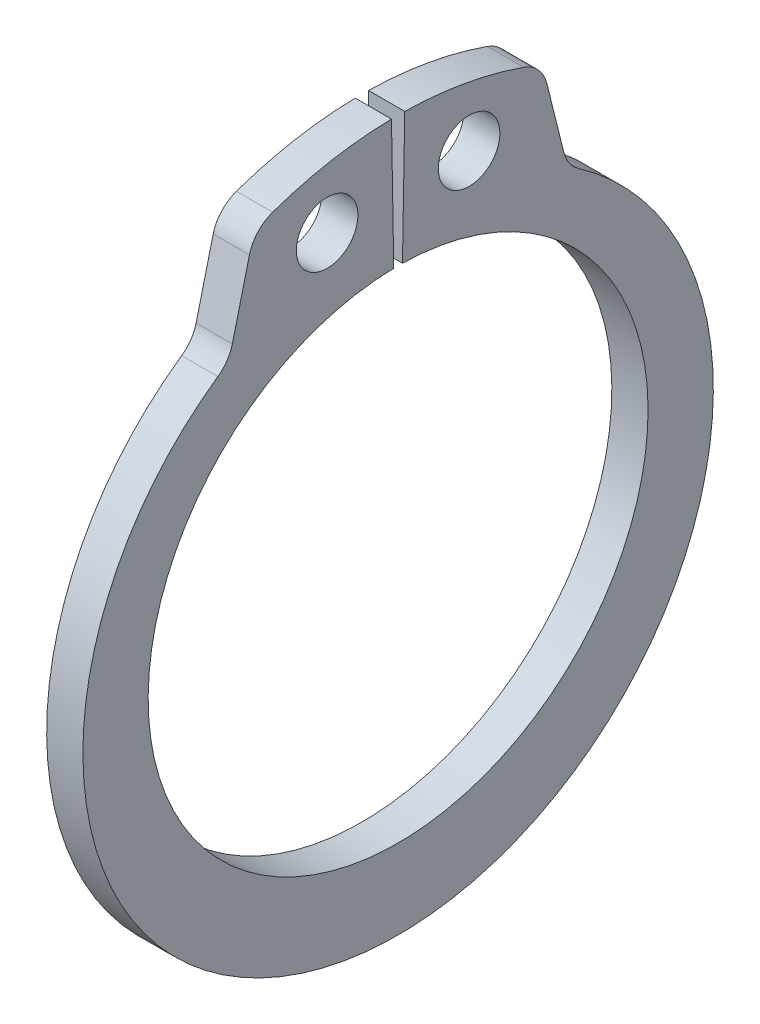
ISO-10303-21;
HEADER;
FILE_DESCRIPTION(('STEP AP214'),'2;1');
FILE_NAME('part.step','',(''),(''),'','','');
FILE_SCHEMA(('AUTOMOTIVE_DESIGN { 1 0 10303 214 1 1 1 1 }'));
ENDSEC;
DATA;
#1=APPLICATION_CONTEXT('core data for automotive mechanical design processes');
#2=APPLICATION_PROTOCOL_DEFINITION('international standard','automotive_design',2000,#1);
#3=PRODUCT_CONTEXT('',#1,'mechanical');
#4=PRODUCT('Part','Part','',(#3));
#5=PRODUCT_RELATED_PRODUCT_CATEGORY('part','',(#4));
#6=PRODUCT_DEFINITION_FORMATION('','',#4);
#7=PRODUCT_DEFINITION_CONTEXT('part definition',#1,'design');
#8=PRODUCT_DEFINITION('design','',#6,#7);
#9=PRODUCT_DEFINITION_SHAPE('','',#8);
#10=(LENGTH_UNIT() NAMED_UNIT(*) SI_UNIT(.MILLI.,.METRE.));
#11=(NAMED_UNIT(*) PLANE_ANGLE_UNIT() SI_UNIT($,.RADIAN.));
#12=(NAMED_UNIT(*) SI_UNIT($,.STERADIAN.) SOLID_ANGLE_UNIT());
#13=UNCERTAINTY_MEASURE_WITH_UNIT(LENGTH_MEASURE(1.E-05),#10,'distance_accuracy_value','');
#14=(GEOMETRIC_REPRESENTATION_CONTEXT(3) GLOBAL_UNCERTAINTY_ASSIGNED_CONTEXT((#13)) GLOBAL_UNIT_ASSIGNED_CONTEXT((#10,
#11,#12)) REPRESENTATION_CONTEXT('',''));
#15=CARTESIAN_POINT('',(0.,0.,0.));
#16=DIRECTION('',(0.,0.,1.));
#17=DIRECTION('',(1.,0.,0.));
#18=AXIS2_PLACEMENT_3D('',#15,#16,#17);
#19=CARTESIAN_POINT('',(-0.5,0.,0.));
#20=DIRECTION('',(1.,0.,0.));
#21=DIRECTION('',(0.,1.,0.));
#22=AXIS2_PLACEMENT_3D('',#19,#20,#21);
#23=PLANE('',#22);
#24=CARTESIAN_POINT('',(-0.5,8.66711980549087,-1.9596288316201));
#25=DIRECTION('',(-1.,0.,0.));
#26=DIRECTION('',(0.,-1.,0.));
#27=AXIS2_PLACEMENT_3D('',#24,#25,#26);
#28=CIRCLE('',#27,0.850000000000001);
#29=CARTESIAN_POINT('',(-0.5,7.81711980549087,-1.9596288316201));
#30=VERTEX_POINT('',#29);
#31=EDGE_CURVE('E126',#30,#30,#28,.F.);
#32=ORIENTED_EDGE('',*,*,#31,.T.);
#33=EDGE_LOOP('',(#32));
#34=FACE_BOUND('',#33,.T.);
#35=CARTESIAN_POINT('',(-0.5,8.96816184312503,3.13401869099665));
#36=DIRECTION('',(-1.,0.,0.));
#37=DIRECTION('',(0.,-1.,0.));
#38=AXIS2_PLACEMENT_3D('',#35,#36,#37);
#39=CIRCLE('',#38,1.);
#40=CARTESIAN_POINT('',(-0.5,9.91217887924345,3.46391539531209));
#41=VERTEX_POINT('',#40);
#42=CARTESIAN_POINT('',(-0.5,9.21008373872469,4.10431441727265));
#43=VERTEX_POINT('',#42);
#44=EDGE_CURVE('E112',#41,#43,#39,.F.);
#45=ORIENTED_EDGE('',*,*,#44,.F.);
#46=CARTESIAN_POINT('',(-0.5,0.,0.));
#47=DIRECTION('',(-1.,0.,0.));
#48=DIRECTION('',(0.,-1.,0.));
#49=AXIS2_PLACEMENT_3D('',#46,#47,#48);
#50=CIRCLE('',#49,10.5);
#51=CARTESIAN_POINT('',(-0.5,10.4984007991421,0.183250267591477));
#52=VERTEX_POINT('',#51);
#53=EDGE_CURVE('E105',#52,#41,#50,.F.);
#54=ORIENTED_EDGE('',*,*,#53,.F.);
#55=DIRECTION('',(0.,-0.999847695156391,-0.0174524064372836));
#56=VECTOR('',#55,1.);
#57=CARTESIAN_POINT('',(-0.5,6.8989490965791,0.120421604417256));
#58=LINE('',#57,#56);
#59=CARTESIAN_POINT('',(-0.5,6.8989490965791,0.120421604417256));
#60=VERTEX_POINT('',#59);
#61=EDGE_CURVE('E109',#52,#60,#58,.T.);
#62=ORIENTED_EDGE('',*,*,#61,.T.);
#63=CARTESIAN_POINT('',(-0.5,0.,0.));
#64=DIRECTION('',(-1.,0.,0.));
#65=DIRECTION('',(0.,-1.,0.));
#66=AXIS2_PLACEMENT_3D('',#63,#64,#65);
#67=CIRCLE('',#66,6.9);
#68=CARTESIAN_POINT('',(-0.5,6.8989490965791,-0.120421604417255));
#69=VERTEX_POINT('',#68);
#70=EDGE_CURVE('E172',#60,#69,#67,.F.);
#71=ORIENTED_EDGE('',*,*,#70,.T.);
#72=DIRECTION('',(0.,0.999847695156391,-0.017452406437284));
#73=VECTOR('',#72,1.);
#74=CARTESIAN_POINT('',(-0.5,10.4984007991421,-0.183250267591479));
#75=LINE('',#74,#73);
#76=CARTESIAN_POINT('',(-0.5,10.4984007991421,-0.183250267591479));
#77=VERTEX_POINT('',#76);
#78=EDGE_CURVE('E134',#69,#77,#75,.T.);
#79=ORIENTED_EDGE('',*,*,#78,.T.);
#80=CARTESIAN_POINT('',(-0.5,0.,0.));
#81=DIRECTION('',(-1.,0.,0.));
#82=DIRECTION('',(0.,-1.,0.));
#83=AXIS2_PLACEMENT_3D('',#80,#81,#82);
#84=CIRCLE('',#83,10.5);
#85=CARTESIAN_POINT('',(-0.5,9.91217887924345,-3.4639153953121));
#86=VERTEX_POINT('',#85);
#87=EDGE_CURVE('E174',#86,#77,#84,.F.);
#88=ORIENTED_EDGE('',*,*,#87,.F.);
#89=CARTESIAN_POINT('',(-0.5,8.96816184312503,-3.13401869099666));
#90=DIRECTION('',(-1.,0.,0.));
#91=DIRECTION('',(0.,-1.,0.));
#92=AXIS2_PLACEMENT_3D('',#89,#90,#91);
#93=CIRCLE('',#92,1.);
#94=CARTESIAN_POINT('',(-0.5,9.21008373872469,-4.10431441727266));
#95=VERTEX_POINT('',#94);
#96=EDGE_CURVE('E177',#95,#86,#93,.F.);
#97=ORIENTED_EDGE('',*,*,#96,.F.);
#98=DIRECTION('',(0.,-0.970295726275997,-0.241921895599666));
#99=VECTOR('',#98,1.);
#100=CARTESIAN_POINT('',(-0.500000000000001,9.7173447274592,-3.97784004803122));
#101=LINE('',#100,#99);
#102=CARTESIAN_POINT('',(-0.5,7.31761530924591,-4.57615979123836));
#103=VERTEX_POINT('',#102);
#104=EDGE_CURVE('E139',#95,#103,#101,.T.);
#105=ORIENTED_EDGE('',*,*,#104,.T.);
#106=CARTESIAN_POINT('',(-0.5,7.55953720484558,-5.54645551751437));
#107=DIRECTION('',(-1.,0.,0.));
#108=DIRECTION('',(0.,-1.,0.));
#109=AXIS2_PLACEMENT_3D('',#106,#107,#108);
#110=CIRCLE('',#109,1.);
#111=CARTESIAN_POINT('',(-0.5,6.73911195964234,-4.97470170945254));
#112=VERTEX_POINT('',#111);
#113=EDGE_CURVE('E179',#103,#112,#110,.F.);
#114=ORIENTED_EDGE('',*,*,#113,.T.);
#115=CARTESIAN_POINT('',(-0.5,-0.399224177769539,0.));
#116=DIRECTION('',(-1.,0.,0.));
#117=DIRECTION('',(0.,-1.,0.));
#118=AXIS2_PLACEMENT_3D('',#115,#116,#117);
#119=CIRCLE('',#118,8.70077582223047);
#120=CARTESIAN_POINT('',(-0.5,6.73911195964234,4.97470170945253));
#121=VERTEX_POINT('',#120);
#122=EDGE_CURVE('E182',#121,#112,#119,.F.);
#123=ORIENTED_EDGE('',*,*,#122,.F.);
#124=CARTESIAN_POINT('',(-0.5,7.55953720484558,5.54645551751436));
#125=DIRECTION('',(-1.,0.,0.));
#126=DIRECTION('',(0.,-1.,0.));
#127=AXIS2_PLACEMENT_3D('',#124,#125,#126);
#128=CIRCLE('',#127,1.);
#129=CARTESIAN_POINT('',(-0.5,7.31761530924592,4.57615979123836));
#130=VERTEX_POINT('',#129);
#131=EDGE_CURVE('E145',#121,#130,#128,.F.);
#132=ORIENTED_EDGE('',*,*,#131,.T.);
#133=DIRECTION('',(0.,0.970295726275997,-0.241921895599665));
#134=VECTOR('',#133,1.);
#135=CARTESIAN_POINT('',(-0.5,9.7173447274592,3.97784004803122));
#136=LINE('',#135,#134);
#137=EDGE_CURVE('E144',#130,#43,#136,.T.);
#138=ORIENTED_EDGE('',*,*,#137,.T.);
#139=EDGE_LOOP('',(#45,#54,#62,#71,#79,#88,#97,#105,#114,#123,#132,#138));
#140=FACE_BOUND('',#139,.T.);
#141=CARTESIAN_POINT('',(-0.5,8.66711980549087,1.9596288316201));
#142=DIRECTION('',(-1.,0.,0.));
#143=DIRECTION('',(0.,-1.,0.));
#144=AXIS2_PLACEMENT_3D('',#141,#142,#143);
#145=CIRCLE('',#144,0.850000000000001);
#146=CARTESIAN_POINT('',(-0.5,7.81711980549087,1.9596288316201));
#147=VERTEX_POINT('',#146);
#148=EDGE_CURVE('E20',#147,#147,#145,.F.);
#149=ORIENTED_EDGE('',*,*,#148,.T.);
#150=EDGE_LOOP('',(#149));
#151=FACE_BOUND('',#150,.T.);
#152=ADVANCED_FACE('F17',(#34,#140,#151),#23,.F.);
#153=CARTESIAN_POINT('',(0.5,8.66711980549087,1.9596288316201));
#154=DIRECTION('',(-1.,0.,0.));
#155=DIRECTION('',(0.,-1.,0.));
#156=AXIS2_PLACEMENT_3D('',#153,#154,#155);
#157=CYLINDRICAL_SURFACE('',#156,0.850000000000001);
#158=CARTESIAN_POINT('',(0.5,8.66711980549087,1.9596288316201));
#159=DIRECTION('',(-1.,0.,0.));
#160=DIRECTION('',(0.,-1.,0.));
#161=AXIS2_PLACEMENT_3D('',#158,#159,#160);
#162=CIRCLE('',#161,0.850000000000001);
#163=CARTESIAN_POINT('',(0.5,7.81711980549087,1.9596288316201));
#164=VERTEX_POINT('',#163);
#165=EDGE_CURVE('E129',#164,#164,#162,.T.);
#166=ORIENTED_EDGE('',*,*,#165,.F.);
#167=EDGE_LOOP('',(#166));
#168=FACE_BOUND('',#167,.T.);
#169=ORIENTED_EDGE('',*,*,#148,.F.);
#170=EDGE_LOOP('',(#169));
#171=FACE_BOUND('',#170,.T.);
#172=ADVANCED_FACE('F272',(#168,#171),#157,.F.);
#173=CARTESIAN_POINT('',(0.5,0.,0.));
#174=DIRECTION('',(-1.,0.,0.));
#175=DIRECTION('',(0.,-1.,0.));
#176=AXIS2_PLACEMENT_3D('',#173,#174,#175);
#177=CYLINDRICAL_SURFACE('',#176,10.5);
#178=CARTESIAN_POINT('',(0.5,0.,0.));
#179=DIRECTION('',(-1.,0.,0.));
#180=DIRECTION('',(0.,-1.,0.));
#181=AXIS2_PLACEMENT_3D('',#178,#179,#180);
#182=CIRCLE('',#181,10.5);
#183=CARTESIAN_POINT('',(0.5,10.4984007991421,0.183250267591477));
#184=VERTEX_POINT('',#183);
#185=CARTESIAN_POINT('',(0.5,9.91217887924345,3.46391539531209));
#186=VERTEX_POINT('',#185);
#187=EDGE_CURVE('E120',#184,#186,#182,.F.);
#188=ORIENTED_EDGE('',*,*,#187,.F.);
#189=DIRECTION('',(1.,0.,0.));
#190=VECTOR('',#189,1.);
#191=CARTESIAN_POINT('',(0.5,10.4984007991421,0.183250267591477));
#192=LINE('',#191,#190);
#193=EDGE_CURVE('E117',#184,#52,#192,.F.);
#194=ORIENTED_EDGE('',*,*,#193,.T.);
#195=ORIENTED_EDGE('',*,*,#53,.T.);
#196=DIRECTION('',(-1.,0.,0.));
#197=VECTOR('',#196,1.);
#198=CARTESIAN_POINT('',(0.5,9.91217887924345,3.46391539531209));
#199=LINE('',#198,#197);
#200=EDGE_CURVE('E115',#186,#41,#199,.T.);
#201=ORIENTED_EDGE('',*,*,#200,.F.);
#202=EDGE_LOOP('',(#188,#194,#195,#201));
#203=FACE_BOUND('',#202,.T.);
#204=ADVANCED_FACE('F118',(#203),#177,.T.);
#205=CARTESIAN_POINT('',(0.5,8.96816184312503,3.13401869099665));
#206=DIRECTION('',(-1.,0.,0.));
#207=DIRECTION('',(0.,-1.,0.));
#208=AXIS2_PLACEMENT_3D('',#205,#206,#207);
#209=CYLINDRICAL_SURFACE('',#208,1.);
#210=ORIENTED_EDGE('',*,*,#44,.T.);
#211=DIRECTION('',(1.,0.,0.));
#212=VECTOR('',#211,1.);
#213=CARTESIAN_POINT('',(0.5,9.21008373872469,4.10431441727265));
#214=LINE('',#213,#212);
#215=CARTESIAN_POINT('',(0.5,9.21008373872469,4.10431441727265));
#216=VERTEX_POINT('',#215);
#217=EDGE_CURVE('E146',#43,#216,#214,.T.);
#218=ORIENTED_EDGE('',*,*,#217,.T.);
#219=CARTESIAN_POINT('',(0.5,8.96816184312503,3.13401869099665));
#220=DIRECTION('',(-1.,0.,0.));
#221=DIRECTION('',(0.,-1.,0.));
#222=AXIS2_PLACEMENT_3D('',#219,#220,#221);
#223=CIRCLE('',#222,1.);
#224=EDGE_CURVE('E166',#186,#216,#223,.F.);
#225=ORIENTED_EDGE('',*,*,#224,.F.);
#226=ORIENTED_EDGE('',*,*,#200,.T.);
#227=EDGE_LOOP('',(#210,#218,#225,#226));
#228=FACE_BOUND('',#227,.T.);
#229=ADVANCED_FACE('F190',(#228),#209,.T.);
#230=CARTESIAN_POINT('',(0.5,9.7173447274592,3.97784004803122));
#231=DIRECTION('',(0.,-0.241921895599665,-0.970295726275997));
#232=DIRECTION('',(0.,0.970295726275997,-0.241921895599665));
#233=AXIS2_PLACEMENT_3D('',#230,#231,#232);
#234=PLANE('',#233);
#235=DIRECTION('',(-1.,0.,0.));
#236=VECTOR('',#235,1.);
#237=CARTESIAN_POINT('',(0.5,7.31761530924592,4.57615979123836));
#238=LINE('',#237,#236);
#239=CARTESIAN_POINT('',(0.5,7.31761530924592,4.57615979123836));
#240=VERTEX_POINT('',#239);
#241=EDGE_CURVE('E187',#130,#240,#238,.F.);
#242=ORIENTED_EDGE('',*,*,#241,.T.);
#243=DIRECTION('',(0.,-0.970295726275997,0.241921895599666));
#244=VECTOR('',#243,1.);
#245=CARTESIAN_POINT('',(0.5,9.21008373872469,4.10431441727265));
#246=LINE('',#245,#244);
#247=EDGE_CURVE('E165',#216,#240,#246,.T.);
#248=ORIENTED_EDGE('',*,*,#247,.F.);
#249=ORIENTED_EDGE('',*,*,#217,.F.);
#250=ORIENTED_EDGE('',*,*,#137,.F.);
#251=EDGE_LOOP('',(#242,#248,#249,#250));
#252=FACE_BOUND('',#251,.T.);
#253=ADVANCED_FACE('F218',(#252),#234,.F.);
#254=CARTESIAN_POINT('',(0.5,7.55953720484558,5.54645551751436));
#255=DIRECTION('',(-1.,0.,0.));
#256=DIRECTION('',(0.,-1.,0.));
#257=AXIS2_PLACEMENT_3D('',#254,#255,#256);
#258=CYLINDRICAL_SURFACE('',#257,1.);
#259=ORIENTED_EDGE('',*,*,#241,.F.);
#260=ORIENTED_EDGE('',*,*,#131,.F.);
#261=DIRECTION('',(-1.,0.,0.));
#262=VECTOR('',#261,1.);
#263=CARTESIAN_POINT('',(0.5,6.73911195964234,4.97470170945253));
#264=LINE('',#263,#262);
#265=CARTESIAN_POINT('',(0.5,6.73911195964234,4.97470170945253));
#266=VERTEX_POINT('',#265);
#267=EDGE_CURVE('E185',#266,#121,#264,.T.);
#268=ORIENTED_EDGE('',*,*,#267,.F.);
#269=CARTESIAN_POINT('',(0.5,7.55953720484558,5.54645551751436));
#270=DIRECTION('',(-1.,0.,0.));
#271=DIRECTION('',(0.,-1.,0.));
#272=AXIS2_PLACEMENT_3D('',#269,#270,#271);
#273=CIRCLE('',#272,1.);
#274=EDGE_CURVE('E162',#240,#266,#273,.T.);
#275=ORIENTED_EDGE('',*,*,#274,.F.);
#276=EDGE_LOOP('',(#259,#260,#268,#275));
#277=FACE_BOUND('',#276,.T.);
#278=ADVANCED_FACE('F221',(#277),#258,.F.);
#279=CARTESIAN_POINT('',(0.5,-0.399224177769539,0.));
#280=DIRECTION('',(-1.,0.,0.));
#281=DIRECTION('',(0.,-1.,0.));
#282=AXIS2_PLACEMENT_3D('',#279,#280,#281);
#283=CYLINDRICAL_SURFACE('',#282,8.70077582223047);
#284=ORIENTED_EDGE('',*,*,#122,.T.);
#285=DIRECTION('',(-1.,0.,0.));
#286=VECTOR('',#285,1.);
#287=CARTESIAN_POINT('',(0.5,6.73911195964234,-4.97470170945254));
#288=LINE('',#287,#286);
#289=CARTESIAN_POINT('',(0.5,6.73911195964234,-4.97470170945254));
#290=VERTEX_POINT('',#289);
#291=EDGE_CURVE('E181',#112,#290,#288,.F.);
#292=ORIENTED_EDGE('',*,*,#291,.T.);
#293=CARTESIAN_POINT('',(0.5,-0.399224177769539,0.));
#294=DIRECTION('',(-1.,0.,0.));
#295=DIRECTION('',(0.,-1.,0.));
#296=AXIS2_PLACEMENT_3D('',#293,#294,#295);
#297=CIRCLE('',#296,8.70077582223047);
#298=EDGE_CURVE('E160',#266,#290,#297,.F.);
#299=ORIENTED_EDGE('',*,*,#298,.F.);
#300=ORIENTED_EDGE('',*,*,#267,.T.);
#301=EDGE_LOOP('',(#284,#292,#299,#300));
#302=FACE_BOUND('',#301,.T.);
#303=ADVANCED_FACE('F226',(#302),#283,.T.);
#304=CARTESIAN_POINT('',(0.5,7.55953720484558,-5.54645551751437));
#305=DIRECTION('',(-1.,0.,0.));
#306=DIRECTION('',(0.,-1.,0.));
#307=AXIS2_PLACEMENT_3D('',#304,#305,#306);
#308=CYLINDRICAL_SURFACE('',#307,1.);
#309=ORIENTED_EDGE('',*,*,#291,.F.);
#310=ORIENTED_EDGE('',*,*,#113,.F.);
#311=DIRECTION('',(1.,0.,0.));
#312=VECTOR('',#311,1.);
#313=CARTESIAN_POINT('',(0.5,7.31761530924591,-4.57615979123837));
#314=LINE('',#313,#312);
#315=CARTESIAN_POINT('',(0.5,7.31761530924591,-4.57615979123837));
#316=VERTEX_POINT('',#315);
#317=EDGE_CURVE('E143',#103,#316,#314,.T.);
#318=ORIENTED_EDGE('',*,*,#317,.T.);
#319=CARTESIAN_POINT('',(0.5,7.55953720484558,-5.54645551751437));
#320=DIRECTION('',(-1.,0.,0.));
#321=DIRECTION('',(0.,-1.,0.));
#322=AXIS2_PLACEMENT_3D('',#319,#320,#321);
#323=CIRCLE('',#322,1.);
#324=EDGE_CURVE('E157',#290,#316,#323,.T.);
#325=ORIENTED_EDGE('',*,*,#324,.F.);
#326=EDGE_LOOP('',(#309,#310,#318,#325));
#327=FACE_BOUND('',#326,.T.);
#328=ADVANCED_FACE('F228',(#327),#308,.F.);
#329=CARTESIAN_POINT('',(0.5,9.7173447274592,-3.97784004803122));
#330=DIRECTION('',(0.,-0.241921895599666,0.970295726275997));
#331=DIRECTION('',(0.,-0.970295726275997,-0.241921895599666));
#332=AXIS2_PLACEMENT_3D('',#329,#330,#331);
#333=PLANE('',#332);
#334=DIRECTION('',(-1.,0.,0.));
#335=VECTOR('',#334,1.);
#336=CARTESIAN_POINT('',(0.5,9.21008373872469,-4.10431441727266));
#337=LINE('',#336,#335);
#338=CARTESIAN_POINT('',(0.5,9.21008373872469,-4.10431441727266));
#339=VERTEX_POINT('',#338);
#340=EDGE_CURVE('E142',#339,#95,#337,.T.);
#341=ORIENTED_EDGE('',*,*,#340,.F.);
#342=DIRECTION('',(0.,0.970295726275997,0.241921895599666));
#343=VECTOR('',#342,1.);
#344=CARTESIAN_POINT('',(0.5,7.31761530924591,-4.57615979123837));
#345=LINE('',#344,#343);
#346=EDGE_CURVE('E156',#316,#339,#345,.T.);
#347=ORIENTED_EDGE('',*,*,#346,.F.);
#348=ORIENTED_EDGE('',*,*,#317,.F.);
#349=ORIENTED_EDGE('',*,*,#104,.F.);
#350=EDGE_LOOP('',(#341,#347,#348,#349));
#351=FACE_BOUND('',#350,.T.);
#352=ADVANCED_FACE('F232',(#351),#333,.F.);
#353=CARTESIAN_POINT('',(0.5,8.96816184312503,-3.13401869099666));
#354=DIRECTION('',(-1.,0.,0.));
#355=DIRECTION('',(0.,-1.,0.));
#356=AXIS2_PLACEMENT_3D('',#353,#354,#355);
#357=CYLINDRICAL_SURFACE('',#356,1.);
#358=ORIENTED_EDGE('',*,*,#96,.T.);
#359=DIRECTION('',(-1.,0.,0.));
#360=VECTOR('',#359,1.);
#361=CARTESIAN_POINT('',(0.5,9.91217887924345,-3.46391539531209));
#362=LINE('',#361,#360);
#363=CARTESIAN_POINT('',(0.5,9.91217887924345,-3.46391539531209));
#364=VERTEX_POINT('',#363);
#365=EDGE_CURVE('E176',#364,#86,#362,.T.);
#366=ORIENTED_EDGE('',*,*,#365,.F.);
#367=CARTESIAN_POINT('',(0.5,8.96816184312503,-3.13401869099666));
#368=DIRECTION('',(-1.,0.,0.));
#369=DIRECTION('',(0.,-1.,0.));
#370=AXIS2_PLACEMENT_3D('',#367,#368,#369);
#371=CIRCLE('',#370,1.);
#372=EDGE_CURVE('E153',#339,#364,#371,.F.);
#373=ORIENTED_EDGE('',*,*,#372,.F.);
#374=ORIENTED_EDGE('',*,*,#340,.T.);
#375=EDGE_LOOP('',(#358,#366,#373,#374));
#376=FACE_BOUND('',#375,.T.);
#377=ADVANCED_FACE('F236',(#376),#357,.T.);
#378=CARTESIAN_POINT('',(0.5,0.,0.));
#379=DIRECTION('',(-1.,0.,0.));
#380=DIRECTION('',(0.,-1.,0.));
#381=AXIS2_PLACEMENT_3D('',#378,#379,#380);
#382=CYLINDRICAL_SURFACE('',#381,10.5);
#383=ORIENTED_EDGE('',*,*,#87,.T.);
#384=DIRECTION('',(1.,0.,0.));
#385=VECTOR('',#384,1.);
#386=CARTESIAN_POINT('',(0.5,10.4984007991421,-0.183250267591479));
#387=LINE('',#386,#385);
#388=CARTESIAN_POINT('',(0.5,10.4984007991421,-0.183250267591479));
#389=VERTEX_POINT('',#388);
#390=EDGE_CURVE('E138',#77,#389,#387,.T.);
#391=ORIENTED_EDGE('',*,*,#390,.T.);
#392=CARTESIAN_POINT('',(0.5,0.,0.));
#393=DIRECTION('',(-1.,0.,0.));
#394=DIRECTION('',(0.,-1.,0.));
#395=AXIS2_PLACEMENT_3D('',#392,#393,#394);
#396=CIRCLE('',#395,10.5);
#397=EDGE_CURVE('E150',#364,#389,#396,.F.);
#398=ORIENTED_EDGE('',*,*,#397,.F.);
#399=ORIENTED_EDGE('',*,*,#365,.T.);
#400=EDGE_LOOP('',(#383,#391,#398,#399));
#401=FACE_BOUND('',#400,.T.);
#402=ADVANCED_FACE('F240',(#401),#382,.T.);
#403=CARTESIAN_POINT('',(0.5,10.4984007991421,-0.183250267591479));
#404=DIRECTION('',(0.,-0.017452406437284,-0.999847695156391));
#405=DIRECTION('',(0.,0.999847695156391,-0.017452406437284));
#406=AXIS2_PLACEMENT_3D('',#403,#404,#405);
#407=PLANE('',#406);
#408=DIRECTION('',(-1.,0.,0.));
#409=VECTOR('',#408,1.);
#410=CARTESIAN_POINT('',(0.5,6.8989490965791,-0.120421604417254));
#411=LINE('',#410,#409);
#412=CARTESIAN_POINT('',(0.5,6.8989490965791,-0.120421604417255));
#413=VERTEX_POINT('',#412);
#414=EDGE_CURVE('E137',#69,#413,#411,.F.);
#415=ORIENTED_EDGE('',*,*,#414,.T.);
#416=DIRECTION('',(0.,-0.999847695156391,0.017452406437284));
#417=VECTOR('',#416,1.);
#418=CARTESIAN_POINT('',(0.5,10.4984007991421,-0.183250267591479));
#419=LINE('',#418,#417);
#420=EDGE_CURVE('E149',#389,#413,#419,.T.);
#421=ORIENTED_EDGE('',*,*,#420,.F.);
#422=ORIENTED_EDGE('',*,*,#390,.F.);
#423=ORIENTED_EDGE('',*,*,#78,.F.);
#424=EDGE_LOOP('',(#415,#421,#422,#423));
#425=FACE_BOUND('',#424,.T.);
#426=ADVANCED_FACE('F245',(#425),#407,.F.);
#427=CARTESIAN_POINT('',(0.5,0.,0.));
#428=DIRECTION('',(-1.,0.,0.));
#429=DIRECTION('',(0.,-1.,0.));
#430=AXIS2_PLACEMENT_3D('',#427,#428,#429);
#431=CYLINDRICAL_SURFACE('',#430,6.9);
#432=DIRECTION('',(1.,0.,0.));
#433=VECTOR('',#432,1.);
#434=CARTESIAN_POINT('',(0.5,6.8989490965791,0.120421604417256));
#435=LINE('',#434,#433);
#436=CARTESIAN_POINT('',(0.5,6.8989490965791,0.120421604417256));
#437=VERTEX_POINT('',#436);
#438=EDGE_CURVE('E123',#60,#437,#435,.T.);
#439=ORIENTED_EDGE('',*,*,#438,.T.);
#440=CARTESIAN_POINT('',(0.5,0.,0.));
#441=DIRECTION('',(-1.,0.,0.));
#442=DIRECTION('',(0.,-1.,0.));
#443=AXIS2_PLACEMENT_3D('',#440,#441,#442);
#444=CIRCLE('',#443,6.9);
#445=EDGE_CURVE('E35',#413,#437,#444,.T.);
#446=ORIENTED_EDGE('',*,*,#445,.F.);
#447=ORIENTED_EDGE('',*,*,#414,.F.);
#448=ORIENTED_EDGE('',*,*,#70,.F.);
#449=EDGE_LOOP('',(#439,#446,#447,#448));
#450=FACE_BOUND('',#449,.T.);
#451=ADVANCED_FACE('F248',(#450),#431,.F.);
#452=CARTESIAN_POINT('',(0.5,6.8989490965791,0.120421604417256));
#453=DIRECTION('',(0.,-0.0174524064372836,0.999847695156391));
#454=DIRECTION('',(0.,-0.999847695156391,-0.0174524064372836));
#455=AXIS2_PLACEMENT_3D('',#452,#453,#454);
#456=PLANE('',#455);
#457=ORIENTED_EDGE('',*,*,#193,.F.);
#458=DIRECTION('',(0.,0.999847695156391,0.0174524064372837));
#459=VECTOR('',#458,1.);
#460=CARTESIAN_POINT('',(0.5,6.8989490965791,0.120421604417256));
#461=LINE('',#460,#459);
#462=EDGE_CURVE('E26',#437,#184,#461,.T.);
#463=ORIENTED_EDGE('',*,*,#462,.F.);
#464=ORIENTED_EDGE('',*,*,#438,.F.);
#465=ORIENTED_EDGE('',*,*,#61,.F.);
#466=EDGE_LOOP('',(#457,#463,#464,#465));
#467=FACE_BOUND('',#466,.T.);
#468=ADVANCED_FACE('F125',(#467),#456,.F.);
#469=CARTESIAN_POINT('',(0.5,8.66711980549087,-1.9596288316201));
#470=DIRECTION('',(-1.,0.,0.));
#471=DIRECTION('',(0.,-1.,0.));
#472=AXIS2_PLACEMENT_3D('',#469,#470,#471);
#473=CYLINDRICAL_SURFACE('',#472,0.850000000000001);
#474=CARTESIAN_POINT('',(0.5,8.66711980549087,-1.9596288316201));
#475=DIRECTION('',(-1.,0.,0.));
#476=DIRECTION('',(0.,-1.,0.));
#477=AXIS2_PLACEMENT_3D('',#474,#475,#476);
#478=CIRCLE('',#477,0.850000000000001);
#479=CARTESIAN_POINT('',(0.5,7.81711980549087,-1.9596288316201));
#480=VERTEX_POINT('',#479);
#481=EDGE_CURVE('E11',#480,#480,#478,.T.);
#482=ORIENTED_EDGE('',*,*,#481,.F.);
#483=EDGE_LOOP('',(#482));
#484=FACE_BOUND('',#483,.T.);
#485=ORIENTED_EDGE('',*,*,#31,.F.);
#486=EDGE_LOOP('',(#485));
#487=FACE_BOUND('',#486,.T.);
#488=ADVANCED_FACE('F256',(#484,#487),#473,.F.);
#489=CARTESIAN_POINT('',(0.5,0.,0.));
#490=DIRECTION('',(1.,0.,0.));
#491=DIRECTION('',(0.,1.,0.));
#492=AXIS2_PLACEMENT_3D('',#489,#490,#491);
#493=PLANE('',#492);
#494=ORIENTED_EDGE('',*,*,#481,.T.);
#495=EDGE_LOOP('',(#494));
#496=FACE_BOUND('',#495,.T.);
#497=ORIENTED_EDGE('',*,*,#445,.T.);
#498=ORIENTED_EDGE('',*,*,#462,.T.);
#499=ORIENTED_EDGE('',*,*,#187,.T.);
#500=ORIENTED_EDGE('',*,*,#224,.T.);
#501=ORIENTED_EDGE('',*,*,#247,.T.);
#502=ORIENTED_EDGE('',*,*,#274,.T.);
#503=ORIENTED_EDGE('',*,*,#298,.T.);
#504=ORIENTED_EDGE('',*,*,#324,.T.);
#505=ORIENTED_EDGE('',*,*,#346,.T.);
#506=ORIENTED_EDGE('',*,*,#372,.T.);
#507=ORIENTED_EDGE('',*,*,#397,.T.);
#508=ORIENTED_EDGE('',*,*,#420,.T.);
#509=EDGE_LOOP('',(#497,#498,#499,#500,#501,#502,#503,#504,#505,#506,#507,#508));
#510=FACE_BOUND('',#509,.T.);
#511=ORIENTED_EDGE('',*,*,#165,.T.);
#512=EDGE_LOOP('',(#511));
#513=FACE_BOUND('',#512,.T.);
#514=ADVANCED_FACE('F194',(#496,#510,#513),#493,.T.);
#515=CLOSED_SHELL('',(#152,#172,#204,#229,#253,#278,#303,#328,#352,#377,#402,#426,#451,#468,
#488,#514));
#516=MANIFOLD_SOLID_BREP('B1',#515);
#517=ADVANCED_BREP_SHAPE_REPRESENTATION('',(#18,#516),#14);
#518=SHAPE_DEFINITION_REPRESENTATION(#9,#517);
ENDSEC;
END-ISO-10303-21;
